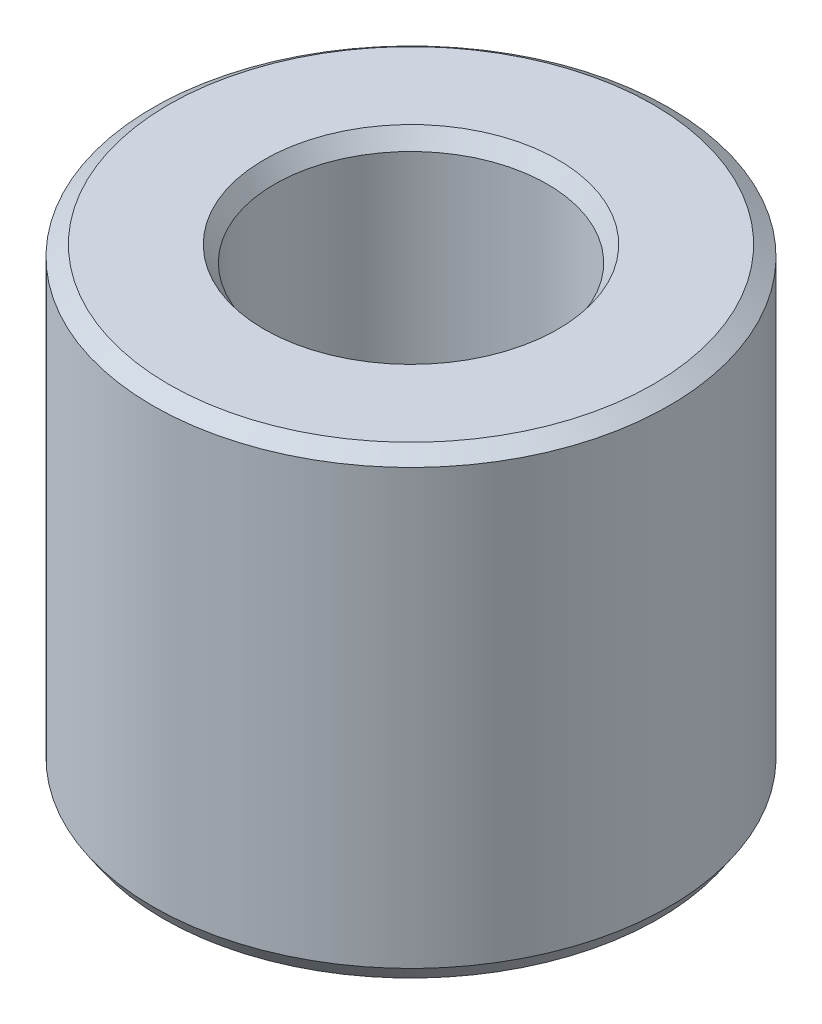
ISO-10303-21;
HEADER;
FILE_DESCRIPTION(('STEP AP214'),'2;1');
FILE_NAME('part.step','',(''),(''),'','','');
FILE_SCHEMA(('AUTOMOTIVE_DESIGN { 1 0 10303 214 1 1 1 1 }'));
ENDSEC;
DATA;
#1=APPLICATION_CONTEXT('core data for automotive mechanical design processes');
#2=APPLICATION_PROTOCOL_DEFINITION('international standard','automotive_design',2000,#1);
#3=PRODUCT_CONTEXT('',#1,'mechanical');
#4=PRODUCT('Part','Part','',(#3));
#5=PRODUCT_RELATED_PRODUCT_CATEGORY('part','',(#4));
#6=PRODUCT_DEFINITION_FORMATION('','',#4);
#7=PRODUCT_DEFINITION_CONTEXT('part definition',#1,'design');
#8=PRODUCT_DEFINITION('design','',#6,#7);
#9=PRODUCT_DEFINITION_SHAPE('','',#8);
#10=(LENGTH_UNIT() NAMED_UNIT(*) SI_UNIT(.MILLI.,.METRE.));
#11=(NAMED_UNIT(*) PLANE_ANGLE_UNIT() SI_UNIT($,.RADIAN.));
#12=(NAMED_UNIT(*) SI_UNIT($,.STERADIAN.) SOLID_ANGLE_UNIT());
#13=UNCERTAINTY_MEASURE_WITH_UNIT(LENGTH_MEASURE(1.E-05),#10,'distance_accuracy_value','');
#14=(GEOMETRIC_REPRESENTATION_CONTEXT(3) GLOBAL_UNCERTAINTY_ASSIGNED_CONTEXT((#13)) GLOBAL_UNIT_ASSIGNED_CONTEXT((#10,
#11,#12)) REPRESENTATION_CONTEXT('',''));
#15=CARTESIAN_POINT('',(0.,0.,0.));
#16=DIRECTION('',(0.,0.,1.));
#17=DIRECTION('',(1.,0.,0.));
#18=AXIS2_PLACEMENT_3D('',#15,#16,#17);
#19=CARTESIAN_POINT('',(0.,80.2456941419617,0.));
#20=DIRECTION('',(0.,-1.,0.));
#21=DIRECTION('',(0.,0.,-1.));
#22=AXIS2_PLACEMENT_3D('',#19,#20,#21);
#23=CYLINDRICAL_SURFACE('',#22,45.);
#24=CARTESIAN_POINT('',(0.,2.76034368636037,0.));
#25=DIRECTION('',(0.,1.,0.));
#26=DIRECTION('',(0.,0.,1.));
#27=AXIS2_PLACEMENT_3D('',#24,#25,#26);
#28=CIRCLE('',#27,45.);
#29=CARTESIAN_POINT('',(0.,2.76034368636037,45.));
#30=VERTEX_POINT('',#29);
#31=EDGE_CURVE('E10',#30,#30,#28,.T.);
#32=ORIENTED_EDGE('',*,*,#31,.T.);
#33=EDGE_LOOP('',(#32));
#34=FACE_BOUND('',#33,.T.);
#35=CARTESIAN_POINT('',(0.,78.394358405961,0.));
#36=DIRECTION('',(0.,1.,0.));
#37=DIRECTION('',(0.,0.,1.));
#38=AXIS2_PLACEMENT_3D('',#35,#36,#37);
#39=CIRCLE('',#38,45.);
#40=CARTESIAN_POINT('',(0.,78.394358405961,-45.));
#41=VERTEX_POINT('',#40);
#42=EDGE_CURVE('E50',#41,#41,#39,.F.);
#43=ORIENTED_EDGE('',*,*,#42,.T.);
#44=EDGE_LOOP('',(#43));
#45=FACE_BOUND('',#44,.T.);
#46=ADVANCED_FACE('F39',(#34,#45),#23,.T.);
#47=CARTESIAN_POINT('',(0.,80.2456941419617,0.));
#48=DIRECTION('',(0.,1.,0.));
#49=DIRECTION('',(0.,0.,1.));
#50=AXIS2_PLACEMENT_3D('',#47,#48,#49);
#51=PLANE('',#50);
#52=CARTESIAN_POINT('',(0.,80.2456941419617,0.));
#53=DIRECTION('',(0.,1.,0.));
#54=DIRECTION('',(0.,0.,1.));
#55=AXIS2_PLACEMENT_3D('',#52,#53,#54);
#56=CIRCLE('',#55,25.6101907959941);
#57=CARTESIAN_POINT('',(0.,80.2456941419617,25.6101907959941));
#58=VERTEX_POINT('',#57);
#59=EDGE_CURVE('E58',#58,#58,#56,.F.);
#60=ORIENTED_EDGE('',*,*,#59,.T.);
#61=EDGE_LOOP('',(#60));
#62=FACE_BOUND('',#61,.T.);
#63=CARTESIAN_POINT('',(0.,80.2456941419617,0.));
#64=DIRECTION('',(0.,1.,0.));
#65=DIRECTION('',(0.,0.,1.));
#66=AXIS2_PLACEMENT_3D('',#63,#64,#65);
#67=CIRCLE('',#66,42.2396563136396);
#68=CARTESIAN_POINT('',(0.,80.2456941419617,-42.2396563136396));
#69=VERTEX_POINT('',#68);
#70=EDGE_CURVE('E61',#69,#69,#67,.T.);
#71=ORIENTED_EDGE('',*,*,#70,.T.);
#72=EDGE_LOOP('',(#71));
#73=FACE_BOUND('',#72,.T.);
#74=ADVANCED_FACE('F88',(#62,#73),#51,.T.);
#75=CARTESIAN_POINT('',(0.,0.,0.));
#76=DIRECTION('',(0.,1.,0.));
#77=DIRECTION('',(0.,0.,1.));
#78=AXIS2_PLACEMENT_3D('',#75,#76,#77);
#79=PLANE('',#78);
#80=CARTESIAN_POINT('',(0.,0.,0.));
#81=DIRECTION('',(0.,1.,0.));
#82=DIRECTION('',(0.,0.,1.));
#83=AXIS2_PLACEMENT_3D('',#80,#81,#82);
#84=CIRCLE('',#83,26.5191987463539);
#85=CARTESIAN_POINT('',(0.,0.,26.5191987463539));
#86=VERTEX_POINT('',#85);
#87=EDGE_CURVE('E51',#86,#86,#84,.T.);
#88=ORIENTED_EDGE('',*,*,#87,.T.);
#89=EDGE_LOOP('',(#88));
#90=FACE_BOUND('',#89,.T.);
#91=CARTESIAN_POINT('',(0.,0.,0.));
#92=DIRECTION('',(0.,1.,0.));
#93=DIRECTION('',(0.,0.,1.));
#94=AXIS2_PLACEMENT_3D('',#91,#92,#93);
#95=CIRCLE('',#94,43.1486642639994);
#96=CARTESIAN_POINT('',(0.,0.,43.1486642639994));
#97=VERTEX_POINT('',#96);
#98=EDGE_CURVE('E54',#97,#97,#95,.F.);
#99=ORIENTED_EDGE('',*,*,#98,.T.);
#100=EDGE_LOOP('',(#99));
#101=FACE_BOUND('',#100,.T.);
#102=ADVANCED_FACE('F83',(#90,#101),#79,.F.);
#103=CARTESIAN_POINT('',(0.,80.2456941419617,0.));
#104=DIRECTION('',(0.,-1.,0.));
#105=DIRECTION('',(0.,0.,-1.));
#106=AXIS2_PLACEMENT_3D('',#103,#104,#105);
#107=CYLINDRICAL_SURFACE('',#106,23.7588550599934);
#108=CARTESIAN_POINT('',(0.,77.4853504556012,0.));
#109=DIRECTION('',(0.,1.,0.));
#110=DIRECTION('',(0.,0.,1.));
#111=AXIS2_PLACEMENT_3D('',#108,#109,#110);
#112=CIRCLE('',#111,23.7588550599934);
#113=CARTESIAN_POINT('',(0.,77.4853504556012,23.7588550599934));
#114=VERTEX_POINT('',#113);
#115=EDGE_CURVE('E67',#114,#114,#112,.T.);
#116=ORIENTED_EDGE('',*,*,#115,.T.);
#117=EDGE_LOOP('',(#116));
#118=FACE_BOUND('',#117,.T.);
#119=CARTESIAN_POINT('',(0.,1.85133573600065,0.));
#120=DIRECTION('',(0.,1.,0.));
#121=DIRECTION('',(0.,0.,1.));
#122=AXIS2_PLACEMENT_3D('',#119,#120,#121);
#123=CIRCLE('',#122,23.7588550599934);
#124=CARTESIAN_POINT('',(0.,1.85133573600065,23.7588550599934));
#125=VERTEX_POINT('',#124);
#126=EDGE_CURVE('E69',#125,#125,#123,.F.);
#127=ORIENTED_EDGE('',*,*,#126,.T.);
#128=EDGE_LOOP('',(#127));
#129=FACE_BOUND('',#128,.T.);
#130=ADVANCED_FACE('F71',(#118,#129),#107,.F.);
#131=CARTESIAN_POINT('',(0.,77.4853504556012,0.));
#132=DIRECTION('',(0.,1.,0.));
#133=DIRECTION('',(0.,0.,1.));
#134=AXIS2_PLACEMENT_3D('',#131,#132,#133);
#135=CONICAL_SURFACE('',#134,23.7588550599934,0.590783025485793);
#136=ORIENTED_EDGE('',*,*,#59,.F.);
#137=EDGE_LOOP('',(#136));
#138=FACE_BOUND('',#137,.T.);
#139=ORIENTED_EDGE('',*,*,#115,.F.);
#140=EDGE_LOOP('',(#139));
#141=FACE_BOUND('',#140,.T.);
#142=ADVANCED_FACE('F77',(#138,#141),#135,.F.);
#143=CARTESIAN_POINT('',(0.,0.,0.));
#144=DIRECTION('',(0.,-1.,0.));
#145=DIRECTION('',(0.,0.,-1.));
#146=AXIS2_PLACEMENT_3D('',#143,#144,#145);
#147=CONICAL_SURFACE('',#146,26.5191987463539,0.9800133013091);
#148=ORIENTED_EDGE('',*,*,#126,.F.);
#149=EDGE_LOOP('',(#148));
#150=FACE_BOUND('',#149,.T.);
#151=ORIENTED_EDGE('',*,*,#87,.F.);
#152=EDGE_LOOP('',(#151));
#153=FACE_BOUND('',#152,.T.);
#154=ADVANCED_FACE('F73',(#150,#153),#147,.F.);
#155=CARTESIAN_POINT('',(0.,2.76034368636037,0.));
#156=DIRECTION('',(0.,1.,0.));
#157=DIRECTION('',(0.,0.,1.));
#158=AXIS2_PLACEMENT_3D('',#155,#156,#157);
#159=CONICAL_SURFACE('',#158,45.,0.590783025485802);
#160=ORIENTED_EDGE('',*,*,#98,.F.);
#161=EDGE_LOOP('',(#160));
#162=FACE_BOUND('',#161,.T.);
#163=ORIENTED_EDGE('',*,*,#31,.F.);
#164=EDGE_LOOP('',(#163));
#165=FACE_BOUND('',#164,.T.);
#166=ADVANCED_FACE('F76',(#162,#165),#159,.T.);
#167=CARTESIAN_POINT('',(0.,80.2456941419617,0.));
#168=DIRECTION('',(0.,-1.,0.));
#169=DIRECTION('',(0.,0.,-1.));
#170=AXIS2_PLACEMENT_3D('',#167,#168,#169);
#171=CONICAL_SURFACE('',#170,42.2396563136396,0.980013301309099);
#172=CARTESIAN_POINT('',(0.,78.394358405961,-45.));
#173=CARTESIAN_POINT('',(0.,78.413643153211,-44.9712464199338));
#174=CARTESIAN_POINT('',(0.,78.4329279004611,-44.9424928398675));
#175=CARTESIAN_POINT('',(0.,78.4714973949611,-44.884985679735));
#176=CARTESIAN_POINT('',(0.,78.4907821422111,-44.8562320996687));
#177=CARTESIAN_POINT('',(0.,78.5293516367111,-44.7987249395362));
#178=CARTESIAN_POINT('',(0.,78.5486363839611,-44.76997135947));
#179=CARTESIAN_POINT('',(0.,78.5872058784611,-44.7124641993375));
#180=CARTESIAN_POINT('',(0.,78.6064906257111,-44.6837106192712));
#181=CARTESIAN_POINT('',(0.,78.6450601202111,-44.6262034591387));
#182=CARTESIAN_POINT('',(0.,78.6643448674611,-44.5974498790725));
#183=CARTESIAN_POINT('',(0.,78.7029143619611,-44.5399427189399));
#184=CARTESIAN_POINT('',(0.,78.7221991092111,-44.5111891388737));
#185=CARTESIAN_POINT('',(0.,78.7607686037112,-44.4536819787412));
#186=CARTESIAN_POINT('',(0.,78.7800533509612,-44.4249283986749));
#187=CARTESIAN_POINT('',(0.,78.8186228454612,-44.3674212385424));
#188=CARTESIAN_POINT('',(0.,78.8379075927112,-44.3386676584762));
#189=CARTESIAN_POINT('',(0.,78.8764770872112,-44.2811604983437));
#190=CARTESIAN_POINT('',(0.,78.8957618344612,-44.2524069182774));
#191=CARTESIAN_POINT('',(0.,78.9343313289612,-44.1948997581449));
#192=CARTESIAN_POINT('',(0.,78.9536160762112,-44.1661461780786));
#193=CARTESIAN_POINT('',(0.,78.9921855707112,-44.1086390179461));
#194=CARTESIAN_POINT('',(0.,79.0114703179612,-44.0798854378799));
#195=CARTESIAN_POINT('',(0.,79.0500398124613,-44.0223782777474));
#196=CARTESIAN_POINT('',(0.,79.0693245597113,-43.9936246976811));
#197=CARTESIAN_POINT('',(0.,79.1078940542113,-43.9361175375486));
#198=CARTESIAN_POINT('',(0.,79.1271788014613,-43.9073639574824));
#199=CARTESIAN_POINT('',(0.,79.1657482959613,-43.8498567973498));
#200=CARTESIAN_POINT('',(0.,79.1850330432113,-43.8211032172836));
#201=CARTESIAN_POINT('',(0.,79.2236025377113,-43.7635960571511));
#202=CARTESIAN_POINT('',(0.,79.2428872849613,-43.7348424770848));
#203=CARTESIAN_POINT('',(0.,79.2814567794613,-43.6773353169523));
#204=CARTESIAN_POINT('',(0.,79.3007415267113,-43.6485817368861));
#205=CARTESIAN_POINT('',(0.,79.3393110212113,-43.5910745767536));
#206=CARTESIAN_POINT('',(0.,79.3585957684614,-43.5623209966873));
#207=CARTESIAN_POINT('',(0.,79.3971652629614,-43.5048138365548));
#208=CARTESIAN_POINT('',(0.,79.4164500102114,-43.4760602564885));
#209=CARTESIAN_POINT('',(0.,79.4550195047114,-43.418553096356));
#210=CARTESIAN_POINT('',(0.,79.4743042519614,-43.3897995162898));
#211=CARTESIAN_POINT('',(0.,79.5128737464614,-43.3322923561573));
#212=CARTESIAN_POINT('',(0.,79.5321584937114,-43.303538776091));
#213=CARTESIAN_POINT('',(0.,79.5707279882114,-43.2460316159585));
#214=CARTESIAN_POINT('',(0.,79.5900127354614,-43.2172780358922));
#215=CARTESIAN_POINT('',(0.,79.6285822299615,-43.1597708757597));
#216=CARTESIAN_POINT('',(0.,79.6478669772115,-43.1310172956935));
#217=CARTESIAN_POINT('',(0.,79.6864364717115,-43.073510135561));
#218=CARTESIAN_POINT('',(0.,79.7057212189615,-43.0447565554947));
#219=CARTESIAN_POINT('',(0.,79.7442907134615,-42.9872493953622));
#220=CARTESIAN_POINT('',(0.,79.7635754607115,-42.958495815296));
#221=CARTESIAN_POINT('',(0.,79.8021449552115,-42.9009886551635));
#222=CARTESIAN_POINT('',(0.,79.8214297024615,-42.8722350750972));
#223=CARTESIAN_POINT('',(0.,79.8599991969615,-42.8147279149647));
#224=CARTESIAN_POINT('',(0.,79.8792839442115,-42.7859743348984));
#225=CARTESIAN_POINT('',(0.,79.9178534387115,-42.7284671747659));
#226=CARTESIAN_POINT('',(0.,79.9371381859616,-42.6997135946997));
#227=CARTESIAN_POINT('',(0.,79.9757076804616,-42.6422064345672));
#228=CARTESIAN_POINT('',(0.,79.9949924277116,-42.6134528545009));
#229=CARTESIAN_POINT('',(0.,80.0335619222116,-42.5559456943684));
#230=CARTESIAN_POINT('',(0.,80.0528466694616,-42.5271921143022));
#231=CARTESIAN_POINT('',(0.,80.0914161639616,-42.4696849541696));
#232=CARTESIAN_POINT('',(0.,80.1107009112116,-42.4409313741034));
#233=CARTESIAN_POINT('',(0.,80.1492704057116,-42.3834242139709));
#234=CARTESIAN_POINT('',(0.,80.1685551529616,-42.3546706339046));
#235=CARTESIAN_POINT('',(0.,80.2071246474616,-42.2971634737721));
#236=CARTESIAN_POINT('',(0.,80.2264093947117,-42.2684098937059));
#237=CARTESIAN_POINT('',(0.,80.2456941419617,-42.2396563136396));
#238=B_SPLINE_CURVE_WITH_KNOTS('',3,(#172,#173,#174,#175,#176,#177,#178,#179,#180,#181,#182,
#183,#184,#185,#186,#187,#188,#189,#190,#191,#192,#193,#194,#195,#196,#197,#198,#199,#200,#201,
#202,#203,#204,#205,#206,#207,#208,#209,#210,#211,#212,#213,#214,#215,#216,#217,#218,#219,#220,
#221,#222,#223,#224,#225,#226,#227,#228,#229,#230,#231,#232,#233,#234,#235,#236,#237),
.UNSPECIFIED.,.F.,.F.,(4,2,2,2,2,2,2,2,2,2,2,2,2,2,2,2,2,2,2,2,2,2,2,2,2,2,2,2,2,2,2,2,4),(0.,
0.103865435001788,0.207730870003562,0.311596305005336,0.415461740007111,0.51932717500889,
0.623192610010665,0.727058045012439,0.830923480014213,0.934788915015988,1.03865435001777,
1.14251978501954,1.24638522002132,1.35025065502309,1.45411609002487,1.55798152502664,
1.66184696002842,1.7657123950302,1.86957783003198,1.97344326503376,2.07730870003553,
2.1811741350373,2.28503957003908,2.38890500504086,2.49277044004263,2.59663587504441,
2.70050131004618,2.80436674504795,2.90823218004973,3.01209761505151,3.11596305005328,
3.21982848505506,3.32369392005684),.UNSPECIFIED.);
#239=EDGE_CURVE('BSEAM45',#41,#69,#238,.T.);
#240=ORIENTED_EDGE('',*,*,#42,.F.);
#241=ORIENTED_EDGE('',*,*,#70,.F.);
#242=ORIENTED_EDGE('',*,*,#239,.T.);
#243=ORIENTED_EDGE('',*,*,#239,.F.);
#244=EDGE_LOOP('',(#240,#242,#241,#243));
#245=FACE_BOUND('',#244,.T.);
#246=ADVANCED_FACE('F45',(#245),#171,.T.);
#247=CLOSED_SHELL('',(#46,#74,#102,#130,#142,#154,#166,#246));
#248=MANIFOLD_SOLID_BREP('B2',#247);
#249=ADVANCED_BREP_SHAPE_REPRESENTATION('',(#18,#248),#14);
#250=SHAPE_DEFINITION_REPRESENTATION(#9,#249);
ENDSEC;
END-ISO-10303-21;
